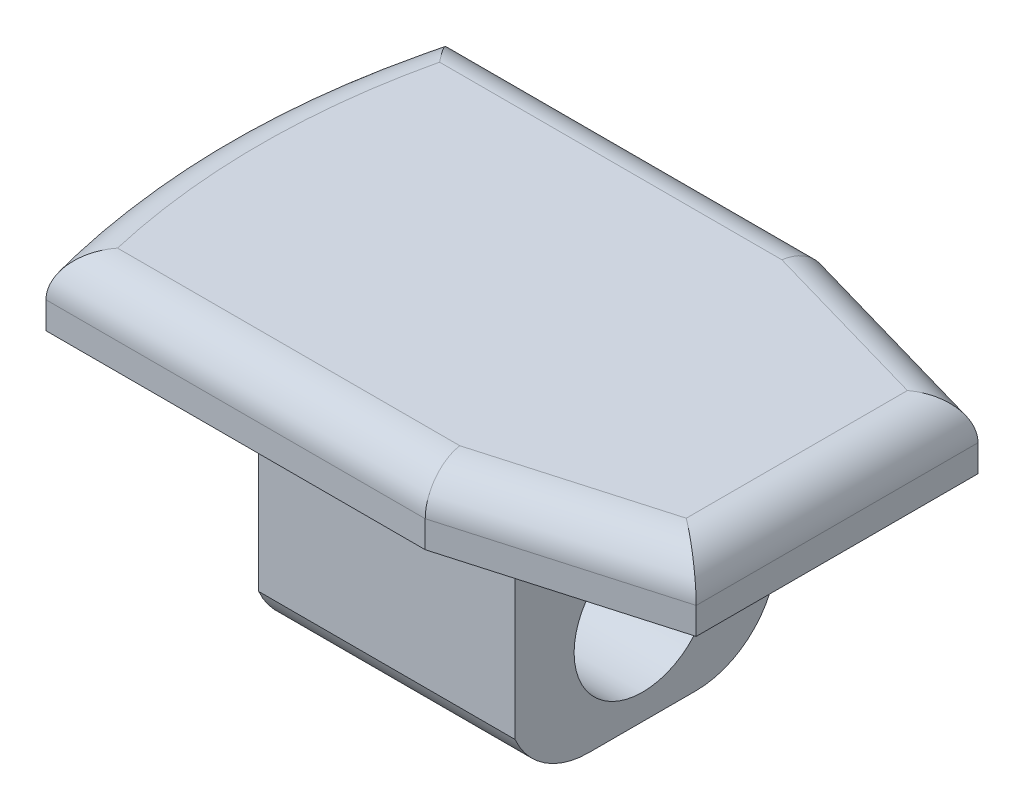
ISO-10303-21;
HEADER;
FILE_DESCRIPTION(('STEP AP214'),'2;1');
FILE_NAME('part.step','',(''),(''),'','','');
FILE_SCHEMA(('AUTOMOTIVE_DESIGN { 1 0 10303 214 1 1 1 1 }'));
ENDSEC;
DATA;
#1=APPLICATION_CONTEXT('core data for automotive mechanical design processes');
#2=APPLICATION_PROTOCOL_DEFINITION('international standard','automotive_design',2000,#1);
#3=PRODUCT_CONTEXT('',#1,'mechanical');
#4=PRODUCT('Part','Part','',(#3));
#5=PRODUCT_RELATED_PRODUCT_CATEGORY('part','',(#4));
#6=PRODUCT_DEFINITION_FORMATION('','',#4);
#7=PRODUCT_DEFINITION_CONTEXT('part definition',#1,'design');
#8=PRODUCT_DEFINITION('design','',#6,#7);
#9=PRODUCT_DEFINITION_SHAPE('','',#8);
#10=(LENGTH_UNIT() NAMED_UNIT(*) SI_UNIT(.MILLI.,.METRE.));
#11=(NAMED_UNIT(*) PLANE_ANGLE_UNIT() SI_UNIT($,.RADIAN.));
#12=(NAMED_UNIT(*) SI_UNIT($,.STERADIAN.) SOLID_ANGLE_UNIT());
#13=UNCERTAINTY_MEASURE_WITH_UNIT(LENGTH_MEASURE(1.E-05),#10,'distance_accuracy_value','');
#14=(GEOMETRIC_REPRESENTATION_CONTEXT(3) GLOBAL_UNCERTAINTY_ASSIGNED_CONTEXT((#13)) GLOBAL_UNIT_ASSIGNED_CONTEXT((#10,
#11,#12)) REPRESENTATION_CONTEXT('',''));
#15=CARTESIAN_POINT('',(0.,0.,0.));
#16=DIRECTION('',(0.,0.,1.));
#17=DIRECTION('',(1.,0.,0.));
#18=AXIS2_PLACEMENT_3D('',#15,#16,#17);
#19=CARTESIAN_POINT('',(0.,2.5,-50.6225865014302));
#20=DIRECTION('',(0.,0.,-1.));
#21=DIRECTION('',(-1.,0.,0.));
#22=AXIS2_PLACEMENT_3D('',#19,#20,#21);
#23=PLANE('',#22);
#24=DIRECTION('',(0.,-1.,0.));
#25=VECTOR('',#24,1.);
#26=CARTESIAN_POINT('',(-34.3395305183971,2.5,-50.6225865014302));
#27=LINE('',#26,#25);
#28=CARTESIAN_POINT('',(-34.3395305183971,1.,-50.6225865014302));
#29=VERTEX_POINT('',#28);
#30=CARTESIAN_POINT('',(-34.3395305183971,0.,-50.6225865014302));
#31=VERTEX_POINT('',#30);
#32=EDGE_CURVE('E284',#29,#31,#27,.T.);
#33=ORIENTED_EDGE('',*,*,#32,.F.);
#34=DIRECTION('',(1.,0.,0.));
#35=VECTOR('',#34,1.);
#36=CARTESIAN_POINT('',(0.,1.,-50.6225865014302));
#37=LINE('',#36,#35);
#38=CARTESIAN_POINT('',(-20.2093710966066,1.,-50.6225865014302));
#39=VERTEX_POINT('',#38);
#40=EDGE_CURVE('E310',#29,#39,#37,.T.);
#41=ORIENTED_EDGE('',*,*,#40,.T.);
#42=DIRECTION('',(0.,-1.,0.));
#43=VECTOR('',#42,1.);
#44=CARTESIAN_POINT('',(-20.2093710966066,2.5,-50.6225865014302));
#45=LINE('',#44,#43);
#46=CARTESIAN_POINT('',(-20.2093710966066,0.,-50.6225865014302));
#47=VERTEX_POINT('',#46);
#48=EDGE_CURVE('E274',#39,#47,#45,.T.);
#49=ORIENTED_EDGE('',*,*,#48,.T.);
#50=DIRECTION('',(1.,0.,0.));
#51=VECTOR('',#50,1.);
#52=CARTESIAN_POINT('',(0.,0.,-50.6225865014302));
#53=LINE('',#52,#51);
#54=EDGE_CURVE('E255',#31,#47,#53,.T.);
#55=ORIENTED_EDGE('',*,*,#54,.F.);
#56=EDGE_LOOP('',(#33,#41,#49,#55));
#57=FACE_BOUND('',#56,.T.);
#58=ADVANCED_FACE('F34',(#57),#23,.T.);
#59=CARTESIAN_POINT('',(-7.36268859796463,2.5,-43.1225865014302));
#60=DIRECTION('',(0.,-1.,0.));
#61=DIRECTION('',(0.,0.,-1.));
#62=AXIS2_PLACEMENT_3D('',#59,#60,#61);
#63=CYLINDRICAL_SURFACE('',#62,28.);
#64=DIRECTION('',(0.,-1.,0.));
#65=VECTOR('',#64,1.);
#66=CARTESIAN_POINT('',(-34.3395305183971,2.5,-35.6225865014302));
#67=LINE('',#66,#65);
#68=CARTESIAN_POINT('',(-34.3395305183971,1.,-35.6225865014302));
#69=VERTEX_POINT('',#68);
#70=CARTESIAN_POINT('',(-34.3395305183971,0.,-35.6225865014302));
#71=VERTEX_POINT('',#70);
#72=EDGE_CURVE('E282',#69,#71,#67,.T.);
#73=ORIENTED_EDGE('',*,*,#72,.F.);
#74=CARTESIAN_POINT('',(-7.36268859796463,1.,-43.1225865014302));
#75=DIRECTION('',(0.,1.,0.));
#76=DIRECTION('',(0.,0.,1.));
#77=AXIS2_PLACEMENT_3D('',#74,#75,#76);
#78=CIRCLE('',#77,28.);
#79=EDGE_CURVE('E308',#69,#29,#78,.F.);
#80=ORIENTED_EDGE('',*,*,#79,.T.);
#81=ORIENTED_EDGE('',*,*,#32,.T.);
#82=CARTESIAN_POINT('',(-7.36268859796463,0.,-43.1225865014302));
#83=DIRECTION('',(0.,1.,0.));
#84=DIRECTION('',(0.,0.,1.));
#85=AXIS2_PLACEMENT_3D('',#82,#83,#84);
#86=CIRCLE('',#85,28.);
#87=EDGE_CURVE('E258',#31,#71,#86,.T.);
#88=ORIENTED_EDGE('',*,*,#87,.T.);
#89=EDGE_LOOP('',(#73,#80,#81,#88));
#90=FACE_BOUND('',#89,.T.);
#91=ADVANCED_FACE('F366',(#90),#63,.T.);
#92=CARTESIAN_POINT('',(0.,2.5,-35.6225865014302));
#93=DIRECTION('',(0.,0.,1.));
#94=DIRECTION('',(1.,0.,0.));
#95=AXIS2_PLACEMENT_3D('',#92,#93,#94);
#96=PLANE('',#95);
#97=DIRECTION('',(0.,-1.,0.));
#98=VECTOR('',#97,1.);
#99=CARTESIAN_POINT('',(-20.2093710966067,2.5,-35.6225865014302));
#100=LINE('',#99,#98);
#101=CARTESIAN_POINT('',(-20.2093710966067,1.,-35.6225865014302));
#102=VERTEX_POINT('',#101);
#103=CARTESIAN_POINT('',(-20.2093710966067,0.,-35.6225865014302));
#104=VERTEX_POINT('',#103);
#105=EDGE_CURVE('E280',#102,#104,#100,.T.);
#106=ORIENTED_EDGE('',*,*,#105,.F.);
#107=DIRECTION('',(-1.,0.,0.));
#108=VECTOR('',#107,1.);
#109=CARTESIAN_POINT('',(0.,1.,-35.6225865014302));
#110=LINE('',#109,#108);
#111=EDGE_CURVE('E306',#102,#69,#110,.T.);
#112=ORIENTED_EDGE('',*,*,#111,.T.);
#113=ORIENTED_EDGE('',*,*,#72,.T.);
#114=DIRECTION('',(-1.,0.,0.));
#115=VECTOR('',#114,1.);
#116=CARTESIAN_POINT('',(0.,0.,-35.6225865014302));
#117=LINE('',#116,#115);
#118=EDGE_CURVE('E262',#104,#71,#117,.T.);
#119=ORIENTED_EDGE('',*,*,#118,.F.);
#120=EDGE_LOOP('',(#106,#112,#113,#119));
#121=FACE_BOUND('',#120,.T.);
#122=ADVANCED_FACE('F372',(#121),#96,.T.);
#123=CARTESIAN_POINT('',(-10.9739736212662,2.5,-38.2707941131326));
#124=DIRECTION('',(0.275637355817,0.,0.961261695938319));
#125=DIRECTION('',(0.961261695938319,0.,-0.275637355817));
#126=AXIS2_PLACEMENT_3D('',#123,#124,#125);
#127=PLANE('',#126);
#128=DIRECTION('',(0.,-1.,0.));
#129=VECTOR('',#128,1.);
#130=CARTESIAN_POINT('',(-12.3626885979646,2.5,-37.8725865014302));
#131=LINE('',#130,#129);
#132=CARTESIAN_POINT('',(-12.3626885979646,1.,-37.8725865014302));
#133=VERTEX_POINT('',#132);
#134=CARTESIAN_POINT('',(-12.3626885979646,0.,-37.8725865014302));
#135=VERTEX_POINT('',#134);
#136=EDGE_CURVE('E278',#133,#135,#131,.T.);
#137=ORIENTED_EDGE('',*,*,#136,.F.);
#138=DIRECTION('',(-0.961261695938319,0.,0.275637355817));
#139=VECTOR('',#138,1.);
#140=CARTESIAN_POINT('',(-10.9739736212662,1.,-38.2707941131326));
#141=LINE('',#140,#139);
#142=EDGE_CURVE('E304',#133,#102,#141,.T.);
#143=ORIENTED_EDGE('',*,*,#142,.T.);
#144=ORIENTED_EDGE('',*,*,#105,.T.);
#145=DIRECTION('',(-0.961261695938319,0.,0.275637355817));
#146=VECTOR('',#145,1.);
#147=CARTESIAN_POINT('',(-10.9739736212662,0.,-38.2707941131326));
#148=LINE('',#147,#146);
#149=EDGE_CURVE('E265',#135,#104,#148,.T.);
#150=ORIENTED_EDGE('',*,*,#149,.F.);
#151=EDGE_LOOP('',(#137,#143,#144,#150));
#152=FACE_BOUND('',#151,.T.);
#153=ADVANCED_FACE('F400',(#152),#127,.T.);
#154=CARTESIAN_POINT('',(-12.3626885979646,2.5,0.));
#155=DIRECTION('',(1.,0.,0.));
#156=DIRECTION('',(0.,0.,-1.));
#157=AXIS2_PLACEMENT_3D('',#154,#155,#156);
#158=PLANE('',#157);
#159=DIRECTION('',(0.,-1.,0.));
#160=VECTOR('',#159,1.);
#161=CARTESIAN_POINT('',(-12.3626885979646,2.5,-48.3725865014302));
#162=LINE('',#161,#160);
#163=CARTESIAN_POINT('',(-12.3626885979646,1.,-48.3725865014302));
#164=VERTEX_POINT('',#163);
#165=CARTESIAN_POINT('',(-12.3626885979646,0.,-48.3725865014302));
#166=VERTEX_POINT('',#165);
#167=EDGE_CURVE('E276',#164,#166,#162,.T.);
#168=ORIENTED_EDGE('',*,*,#167,.F.);
#169=DIRECTION('',(0.,0.,1.));
#170=VECTOR('',#169,1.);
#171=CARTESIAN_POINT('',(-12.3626885979646,1.,0.));
#172=LINE('',#171,#170);
#173=EDGE_CURVE('E302',#164,#133,#172,.T.);
#174=ORIENTED_EDGE('',*,*,#173,.T.);
#175=ORIENTED_EDGE('',*,*,#136,.T.);
#176=DIRECTION('',(0.,0.,1.));
#177=VECTOR('',#176,1.);
#178=CARTESIAN_POINT('',(-12.3626885979646,0.,0.));
#179=LINE('',#178,#177);
#180=EDGE_CURVE('E268',#166,#135,#179,.T.);
#181=ORIENTED_EDGE('',*,*,#180,.F.);
#182=EDGE_LOOP('',(#168,#174,#175,#181));
#183=FACE_BOUND('',#182,.T.);
#184=ADVANCED_FACE('F424',(#183),#158,.T.);
#185=CARTESIAN_POINT('',(11.8775156894045,2.5,-41.4218197721762));
#186=DIRECTION('',(0.275637355817001,0.,-0.961261695938319));
#187=DIRECTION('',(-0.961261695938319,0.,-0.275637355817001));
#188=AXIS2_PLACEMENT_3D('',#185,#186,#187);
#189=PLANE('',#188);
#190=ORIENTED_EDGE('',*,*,#48,.F.);
#191=DIRECTION('',(0.961261695938319,0.,0.275637355817001));
#192=VECTOR('',#191,1.);
#193=CARTESIAN_POINT('',(11.8775156894045,1.,-41.4218197721762));
#194=LINE('',#193,#192);
#195=EDGE_CURVE('E286',#39,#164,#194,.T.);
#196=ORIENTED_EDGE('',*,*,#195,.T.);
#197=ORIENTED_EDGE('',*,*,#167,.T.);
#198=DIRECTION('',(0.961261695938319,0.,0.275637355817001));
#199=VECTOR('',#198,1.);
#200=CARTESIAN_POINT('',(11.8775156894045,0.,-41.4218197721762));
#201=LINE('',#200,#199);
#202=EDGE_CURVE('E271',#47,#166,#201,.T.);
#203=ORIENTED_EDGE('',*,*,#202,.F.);
#204=EDGE_LOOP('',(#190,#196,#197,#203));
#205=FACE_BOUND('',#204,.T.);
#206=ADVANCED_FACE('F418',(#205),#189,.T.);
#207=CARTESIAN_POINT('',(0.,2.5,0.));
#208=DIRECTION('',(0.,1.,0.));
#209=DIRECTION('',(0.,0.,1.));
#210=AXIS2_PLACEMENT_3D('',#207,#208,#209);
#211=PLANE('',#210);
#212=DIRECTION('',(0.,0.,1.));
#213=VECTOR('',#212,1.);
#214=CARTESIAN_POINT('',(-13.8626885979646,2.5,0.));
#215=LINE('',#214,#213);
#216=CARTESIAN_POINT('',(-13.8626885979646,2.5,-39.0029175765844));
#217=VERTEX_POINT('',#216);
#218=CARTESIAN_POINT('',(-13.8626885979646,2.5,-47.242255426276));
#219=VERTEX_POINT('',#218);
#220=EDGE_CURVE('E297',#217,#219,#215,.F.);
#221=ORIENTED_EDGE('',*,*,#220,.T.);
#222=DIRECTION('',(0.961261695938319,0.,0.275637355817001));
#223=VECTOR('',#222,1.);
#224=CARTESIAN_POINT('',(11.464059655679,2.5,-39.9799272282687));
#225=LINE('',#224,#223);
#226=CARTESIAN_POINT('',(-20.4201823486602,2.5,-49.1225865014302));
#227=VERTEX_POINT('',#226);
#228=EDGE_CURVE('E299',#219,#227,#225,.F.);
#229=ORIENTED_EDGE('',*,*,#228,.T.);
#230=DIRECTION('',(1.,0.,0.));
#231=VECTOR('',#230,1.);
#232=CARTESIAN_POINT('',(0.,2.5,-49.1225865014302));
#233=LINE('',#232,#231);
#234=CARTESIAN_POINT('',(-33.1745075962452,2.5,-49.1225865014302));
#235=VERTEX_POINT('',#234);
#236=EDGE_CURVE('E289',#227,#235,#233,.F.);
#237=ORIENTED_EDGE('',*,*,#236,.T.);
#238=CARTESIAN_POINT('',(-7.36268859796463,2.5,-43.1225865014302));
#239=DIRECTION('',(0.,1.,0.));
#240=DIRECTION('',(0.,0.,1.));
#241=AXIS2_PLACEMENT_3D('',#238,#239,#240);
#242=CIRCLE('',#241,26.5);
#243=CARTESIAN_POINT('',(-33.1745075962452,2.5,-37.1225865014302));
#244=VERTEX_POINT('',#243);
#245=EDGE_CURVE('E291',#235,#244,#242,.T.);
#246=ORIENTED_EDGE('',*,*,#245,.T.);
#247=DIRECTION('',(-1.,0.,0.));
#248=VECTOR('',#247,1.);
#249=CARTESIAN_POINT('',(0.,2.5,-37.1225865014302));
#250=LINE('',#249,#248);
#251=CARTESIAN_POINT('',(-20.4201823486603,2.5,-37.1225865014302));
#252=VERTEX_POINT('',#251);
#253=EDGE_CURVE('E293',#244,#252,#250,.F.);
#254=ORIENTED_EDGE('',*,*,#253,.T.);
#255=DIRECTION('',(-0.961261695938319,0.,0.275637355817));
#256=VECTOR('',#255,1.);
#257=CARTESIAN_POINT('',(-11.3874296549917,2.5,-39.7126866570401));
#258=LINE('',#257,#256);
#259=EDGE_CURVE('E295',#252,#217,#258,.F.);
#260=ORIENTED_EDGE('',*,*,#259,.T.);
#261=EDGE_LOOP('',(#221,#229,#237,#246,#254,#260));
#262=FACE_BOUND('',#261,.T.);
#263=ADVANCED_FACE('F431',(#262),#211,.T.);
#264=CARTESIAN_POINT('',(0.,0.,0.));
#265=DIRECTION('',(0.,1.,0.));
#266=DIRECTION('',(0.,0.,1.));
#267=AXIS2_PLACEMENT_3D('',#264,#265,#266);
#268=PLANE('',#267);
#269=ORIENTED_EDGE('',*,*,#54,.T.);
#270=ORIENTED_EDGE('',*,*,#202,.T.);
#271=ORIENTED_EDGE('',*,*,#180,.T.);
#272=ORIENTED_EDGE('',*,*,#149,.T.);
#273=ORIENTED_EDGE('',*,*,#118,.T.);
#274=ORIENTED_EDGE('',*,*,#87,.F.);
#275=EDGE_LOOP('',(#269,#270,#271,#272,#273,#274));
#276=FACE_BOUND('',#275,.T.);
#277=DIRECTION('',(0.,0.,1.));
#278=VECTOR('',#277,1.);
#279=CARTESIAN_POINT('',(-19.6126885979646,0.,-47.8725865014302));
#280=LINE('',#279,#278);
#281=CARTESIAN_POINT('',(-19.6126885979646,0.,-47.8725865014302));
#282=VERTEX_POINT('',#281);
#283=CARTESIAN_POINT('',(-19.6126885979646,0.,-38.3725865014302));
#284=VERTEX_POINT('',#283);
#285=EDGE_CURVE('E191',#282,#284,#280,.T.);
#286=ORIENTED_EDGE('',*,*,#285,.F.);
#287=DIRECTION('',(1.,0.,0.));
#288=VECTOR('',#287,1.);
#289=CARTESIAN_POINT('',(-32.6707900676522,0.,-47.8725865014302));
#290=LINE('',#289,#288);
#291=CARTESIAN_POINT('',(-32.6707900676522,0.,-47.8725865014302));
#292=VERTEX_POINT('',#291);
#293=EDGE_CURVE('E203',#292,#282,#290,.T.);
#294=ORIENTED_EDGE('',*,*,#293,.F.);
#295=CARTESIAN_POINT('',(-7.36268859796419,0.,-43.1225865014302));
#296=DIRECTION('',(0.,-1.,0.));
#297=DIRECTION('',(0.,0.,-1.));
#298=AXIS2_PLACEMENT_3D('',#295,#296,#297);
#299=CIRCLE('',#298,25.7500000000004);
#300=CARTESIAN_POINT('',(-32.6707900676522,0.,-38.3725865014302));
#301=VERTEX_POINT('',#300);
#302=EDGE_CURVE('E194',#301,#292,#299,.T.);
#303=ORIENTED_EDGE('',*,*,#302,.F.);
#304=DIRECTION('',(-1.,0.,0.));
#305=VECTOR('',#304,1.);
#306=CARTESIAN_POINT('',(-19.6126885979646,0.,-38.3725865014302));
#307=LINE('',#306,#305);
#308=EDGE_CURVE('E179',#284,#301,#307,.T.);
#309=ORIENTED_EDGE('',*,*,#308,.F.);
#310=EDGE_LOOP('',(#286,#294,#303,#309));
#311=FACE_BOUND('',#310,.T.);
#312=ADVANCED_FACE('F189',(#276,#311),#268,.F.);
#313=CARTESIAN_POINT('',(0.,1.,-37.1225865014302));
#314=DIRECTION('',(-1.,0.,0.));
#315=DIRECTION('',(0.,0.,1.));
#316=AXIS2_PLACEMENT_3D('',#313,#314,#315);
#317=CYLINDRICAL_SURFACE('',#316,1.5);
#318=CARTESIAN_POINT('',(-20.4201823486602,1.,-37.1225865014302));
#319=DIRECTION('',(-0.99026806874157,0.,0.139173100960066));
#320=DIRECTION('',(-0.139173100960065,0.,-0.990268068741571));
#321=AXIS2_PLACEMENT_3D('',#318,#319,#320);
#322=ELLIPSE('',#321,1.51474135877793,1.5);
#323=EDGE_CURVE('E327',#252,#102,#322,.F.);
#324=ORIENTED_EDGE('',*,*,#323,.F.);
#325=ORIENTED_EDGE('',*,*,#253,.F.);
#326=CARTESIAN_POINT('',(-34.3395305183971,1.,-35.6225865014302));
#327=CARTESIAN_POINT('',(-34.3395328536621,1.03608039633348,-35.6225831912668));
#328=CARTESIAN_POINT('',(-34.3385404683693,1.07214073475895,-35.6238893730918));
#329=CARTESIAN_POINT('',(-34.3345984808231,1.14395069350024,-35.629076334847));
#330=CARTESIAN_POINT('',(-34.3316498387002,1.17970045753022,-35.6329558517845));
#331=CARTESIAN_POINT('',(-34.319969056972,1.28565336330926,-35.6483204930772));
#332=CARTESIAN_POINT('',(-34.3084010639559,1.35505300951268,-35.6635330711589));
#333=CARTESIAN_POINT('',(-34.2783868681752,1.48946757320146,-35.7029622916945));
#334=CARTESIAN_POINT('',(-34.2599513826133,1.5544891372799,-35.7271649044028));
#335=CARTESIAN_POINT('',(-34.217104665054,1.6790332073116,-35.7833376181721));
#336=CARTESIAN_POINT('',(-34.1926856984093,1.73854845715303,-35.815317772599));
#337=CARTESIAN_POINT('',(-34.1369878809526,1.85509812562639,-35.8881407477034));
#338=CARTESIAN_POINT('',(-34.1053485798,1.91166753970272,-35.929447139332));
#339=CARTESIAN_POINT('',(-34.0375150597707,2.01697248513691,-36.0178251568492));
#340=CARTESIAN_POINT('',(-34.0013197309525,2.06570610092307,-36.0648981875339));
#341=CARTESIAN_POINT('',(-33.917993242335,2.16389046813266,-36.173021751085));
#342=CARTESIAN_POINT('',(-33.8701012483687,2.21165520298172,-36.2350143903203));
#343=CARTESIAN_POINT('',(-33.7705728945552,2.29601487337483,-36.3634677470013));
#344=CARTESIAN_POINT('',(-33.718932450196,2.33259739103286,-36.429933332484));
#345=CARTESIAN_POINT('',(-33.601806604551,2.40144117104505,-36.5802156979388));
#346=CARTESIAN_POINT('',(-33.5357063948009,2.4311436552944,-36.6647245167518));
#347=CARTESIAN_POINT('',(-33.4013440779191,2.47497769745559,-36.8358286525521));
#348=CARTESIAN_POINT('',(-33.3330847051392,2.48912819737013,-36.922421299755));
#349=CARTESIAN_POINT('',(-33.236138250163,2.49841641038692,-37.0449135449037));
#350=CARTESIAN_POINT('',(-33.207778480836,2.4998409322229,-37.0806873575064));
#351=CARTESIAN_POINT('',(-33.1777616500822,2.49999580166227,-37.118489085609));
#352=CARTESIAN_POINT('',(-33.1761346692557,2.49999999852218,-37.120537832223));
#353=CARTESIAN_POINT('',(-33.1745075962452,2.5,-37.1225865014302));
#354=B_SPLINE_CURVE_WITH_KNOTS('',3,(#326,#327,#328,#329,#330,#331,#332,#333,#334,#335,#336,
#337,#338,#339,#340,#341,#342,#343,#344,#345,#346,#347,#348,#349,#350,#351,#352,#353),
.UNSPECIFIED.,.F.,.F.,(4,2,2,2,2,2,2,2,2,2,2,2,2,4),(0.,0.108165320883747,0.216277593476679,
0.431044770958129,0.645478183814628,0.860190263630719,1.08992666101489,1.31971913559943,
1.59397754445659,1.86853942079571,2.20128774687989,2.53363034153708,2.67059182436621,
2.67844038135514),.UNSPECIFIED.);
#355=EDGE_CURVE('E259',#69,#244,#354,.T.);
#356=ORIENTED_EDGE('',*,*,#355,.F.);
#357=ORIENTED_EDGE('',*,*,#111,.F.);
#358=EDGE_LOOP('',(#324,#325,#356,#357));
#359=FACE_BOUND('',#358,.T.);
#360=ADVANCED_FACE('F337',(#359),#317,.T.);
#361=CARTESIAN_POINT('',(-7.36268859796463,1.,-43.1225865014302));
#362=DIRECTION('',(0.,1.,0.));
#363=DIRECTION('',(0.,0.,1.));
#364=AXIS2_PLACEMENT_3D('',#361,#362,#363);
#365=TOROIDAL_SURFACE('',#364,26.5,1.5);
#366=ORIENTED_EDGE('',*,*,#355,.T.);
#367=ORIENTED_EDGE('',*,*,#245,.F.);
#368=CARTESIAN_POINT('',(-34.3395305183971,1.,-50.6225865014302));
#369=CARTESIAN_POINT('',(-34.3395328536621,1.03608039633348,-50.6225898115936));
#370=CARTESIAN_POINT('',(-34.3385404683693,1.07214073475895,-50.6212836297686));
#371=CARTESIAN_POINT('',(-34.3345984808231,1.14395069350024,-50.6160966680133));
#372=CARTESIAN_POINT('',(-34.3316498387002,1.17970045753022,-50.6122171510758));
#373=CARTESIAN_POINT('',(-34.319969056972,1.28565336330926,-50.5968525097832));
#374=CARTESIAN_POINT('',(-34.3084010639559,1.35505300951268,-50.5816399317015));
#375=CARTESIAN_POINT('',(-34.2783868681752,1.48946757320146,-50.5422107111658));
#376=CARTESIAN_POINT('',(-34.2599513826133,1.5544891372799,-50.5180080984575));
#377=CARTESIAN_POINT('',(-34.217104665054,1.6790332073116,-50.4618353846883));
#378=CARTESIAN_POINT('',(-34.1926856984093,1.73854845715303,-50.4298552302614));
#379=CARTESIAN_POINT('',(-34.1369878809526,1.85509812562639,-50.357032255157));
#380=CARTESIAN_POINT('',(-34.1053485798,1.91166753970272,-50.3157258635284));
#381=CARTESIAN_POINT('',(-34.0375150597707,2.01697248513691,-50.2273478460112));
#382=CARTESIAN_POINT('',(-34.0013197309525,2.06570610092307,-50.1802748153265));
#383=CARTESIAN_POINT('',(-33.917993242335,2.16389046813266,-50.0721512517754));
#384=CARTESIAN_POINT('',(-33.8701012483687,2.21165520298172,-50.0101586125401));
#385=CARTESIAN_POINT('',(-33.7705728945552,2.29601487337483,-49.8817052558591));
#386=CARTESIAN_POINT('',(-33.718932450196,2.33259739103286,-49.8152396703764));
#387=CARTESIAN_POINT('',(-33.601806604551,2.40144117104505,-49.6649573049216));
#388=CARTESIAN_POINT('',(-33.5357063948009,2.4311436552944,-49.5804484861086));
#389=CARTESIAN_POINT('',(-33.4013440779191,2.47497769745559,-49.4093443503083));
#390=CARTESIAN_POINT('',(-33.3330847051392,2.48912819737013,-49.3227517031054));
#391=CARTESIAN_POINT('',(-33.236138250163,2.49841641038692,-49.2002594579567));
#392=CARTESIAN_POINT('',(-33.207778480836,2.4998409322229,-49.164485645354));
#393=CARTESIAN_POINT('',(-33.1777616500822,2.49999580166227,-49.1266839172514));
#394=CARTESIAN_POINT('',(-33.1761346692557,2.49999999852218,-49.1246351706373));
#395=CARTESIAN_POINT('',(-33.1745075962452,2.5,-49.1225865014302));
#396=B_SPLINE_CURVE_WITH_KNOTS('',3,(#368,#369,#370,#371,#372,#373,#374,#375,#376,#377,#378,
#379,#380,#381,#382,#383,#384,#385,#386,#387,#388,#389,#390,#391,#392,#393,#394,#395),
.UNSPECIFIED.,.F.,.F.,(4,2,2,2,2,2,2,2,2,2,2,2,2,4),(0.,0.108165320883747,0.216277593476679,
0.431044770958129,0.645478183814628,0.860190263630719,1.08992666101489,1.31971913559943,
1.59397754445659,1.86853942079571,2.20128774687989,2.53363034153708,2.67059182436621,
2.67844038135514),.UNSPECIFIED.);
#397=EDGE_CURVE('E319',#29,#235,#396,.T.);
#398=ORIENTED_EDGE('',*,*,#397,.F.);
#399=ORIENTED_EDGE('',*,*,#79,.F.);
#400=EDGE_LOOP('',(#366,#367,#398,#399));
#401=FACE_BOUND('',#400,.T.);
#402=ADVANCED_FACE('F332',(#401),#365,.T.);
#403=CARTESIAN_POINT('',(-11.3874296549917,1.,-39.7126866570401));
#404=DIRECTION('',(-0.961261695938319,0.,0.275637355817));
#405=DIRECTION('',(0.275637355817,0.,0.961261695938319));
#406=AXIS2_PLACEMENT_3D('',#403,#404,#405);
#407=CYLINDRICAL_SURFACE('',#406,1.5);
#408=ORIENTED_EDGE('',*,*,#323,.T.);
#409=ORIENTED_EDGE('',*,*,#142,.F.);
#410=CARTESIAN_POINT('',(-13.8626885979646,1.,-39.0029175765844));
#411=DIRECTION('',(-0.601815023152048,0.,0.798635510047293));
#412=DIRECTION('',(-0.798635510047293,0.,-0.601815023152048));
#413=AXIS2_PLACEMENT_3D('',#410,#411,#412);
#414=ELLIPSE('',#413,1.87820348723434,1.5);
#415=EDGE_CURVE('E316',#217,#133,#414,.F.);
#416=ORIENTED_EDGE('',*,*,#415,.F.);
#417=ORIENTED_EDGE('',*,*,#259,.F.);
#418=EDGE_LOOP('',(#408,#409,#416,#417));
#419=FACE_BOUND('',#418,.T.);
#420=ADVANCED_FACE('F336',(#419),#407,.T.);
#421=CARTESIAN_POINT('',(0.,1.,-49.1225865014302));
#422=DIRECTION('',(1.,0.,0.));
#423=DIRECTION('',(0.,0.,-1.));
#424=AXIS2_PLACEMENT_3D('',#421,#422,#423);
#425=CYLINDRICAL_SURFACE('',#424,1.5);
#426=ORIENTED_EDGE('',*,*,#397,.T.);
#427=ORIENTED_EDGE('',*,*,#236,.F.);
#428=CARTESIAN_POINT('',(-20.4201823486602,1.,-49.1225865014302));
#429=DIRECTION('',(0.99026806874157,0.,0.139173100960066));
#430=DIRECTION('',(0.139173100960066,0.,-0.99026806874157));
#431=AXIS2_PLACEMENT_3D('',#428,#429,#430);
#432=ELLIPSE('',#431,1.51474135877793,1.5);
#433=EDGE_CURVE('E314',#39,#227,#432,.T.);
#434=ORIENTED_EDGE('',*,*,#433,.F.);
#435=ORIENTED_EDGE('',*,*,#40,.F.);
#436=EDGE_LOOP('',(#426,#427,#434,#435));
#437=FACE_BOUND('',#436,.T.);
#438=ADVANCED_FACE('F329',(#437),#425,.T.);
#439=CARTESIAN_POINT('',(-13.8626885979646,1.,0.));
#440=DIRECTION('',(0.,0.,1.));
#441=DIRECTION('',(1.,0.,0.));
#442=AXIS2_PLACEMENT_3D('',#439,#440,#441);
#443=CYLINDRICAL_SURFACE('',#442,1.5);
#444=ORIENTED_EDGE('',*,*,#415,.T.);
#445=ORIENTED_EDGE('',*,*,#173,.F.);
#446=CARTESIAN_POINT('',(-13.8626885979646,1.,-47.242255426276));
#447=DIRECTION('',(0.601815023152048,0.,0.798635510047293));
#448=DIRECTION('',(-0.798635510047293,0.,0.601815023152048));
#449=AXIS2_PLACEMENT_3D('',#446,#447,#448);
#450=ELLIPSE('',#449,1.87820348723434,1.5);
#451=EDGE_CURVE('E254',#219,#164,#450,.F.);
#452=ORIENTED_EDGE('',*,*,#451,.F.);
#453=ORIENTED_EDGE('',*,*,#220,.F.);
#454=EDGE_LOOP('',(#444,#445,#452,#453));
#455=FACE_BOUND('',#454,.T.);
#456=ADVANCED_FACE('F380',(#455),#443,.T.);
#457=CARTESIAN_POINT('',(11.464059655679,1.,-39.9799272282687));
#458=DIRECTION('',(0.961261695938319,0.,0.275637355817001));
#459=DIRECTION('',(0.275637355817001,0.,-0.961261695938319));
#460=AXIS2_PLACEMENT_3D('',#457,#458,#459);
#461=CYLINDRICAL_SURFACE('',#460,1.5);
#462=ORIENTED_EDGE('',*,*,#433,.T.);
#463=ORIENTED_EDGE('',*,*,#228,.F.);
#464=ORIENTED_EDGE('',*,*,#451,.T.);
#465=ORIENTED_EDGE('',*,*,#195,.F.);
#466=EDGE_LOOP('',(#462,#463,#464,#465));
#467=FACE_BOUND('',#466,.T.);
#468=ADVANCED_FACE('F378',(#467),#461,.T.);
#469=CARTESIAN_POINT('',(-19.6126885979646,-10.,-47.8725865014302));
#470=DIRECTION('',(-1.,0.,0.));
#471=DIRECTION('',(0.,0.,1.));
#472=AXIS2_PLACEMENT_3D('',#469,#470,#471);
#473=PLANE('',#472);
#474=CARTESIAN_POINT('',(-19.6126885979646,-6.,-45.1225865014302));
#475=DIRECTION('',(-1.,0.,0.));
#476=DIRECTION('',(0.,0.,1.));
#477=AXIS2_PLACEMENT_3D('',#474,#475,#476);
#478=CIRCLE('',#477,3.);
#479=CARTESIAN_POINT('',(-19.6126885979646,-9.,-45.1225865014302));
#480=VERTEX_POINT('',#479);
#481=CARTESIAN_POINT('',(-19.6126885979646,-7.19895788082821,-47.8725865014302));
#482=VERTEX_POINT('',#481);
#483=EDGE_CURVE('E214',#480,#482,#478,.F.);
#484=ORIENTED_EDGE('',*,*,#483,.T.);
#485=DIRECTION('',(0.,1.,0.));
#486=VECTOR('',#485,1.);
#487=CARTESIAN_POINT('',(-19.6126885979646,-10.,-47.8725865014302));
#488=LINE('',#487,#486);
#489=EDGE_CURVE('E199',#482,#282,#488,.T.);
#490=ORIENTED_EDGE('',*,*,#489,.T.);
#491=ORIENTED_EDGE('',*,*,#285,.T.);
#492=DIRECTION('',(0.,1.,0.));
#493=VECTOR('',#492,1.);
#494=CARTESIAN_POINT('',(-19.6126885979646,-10.,-38.3725865014302));
#495=LINE('',#494,#493);
#496=CARTESIAN_POINT('',(-19.6126885979646,-7.19895788082817,-38.3725865014302));
#497=VERTEX_POINT('',#496);
#498=EDGE_CURVE('E175',#497,#284,#495,.T.);
#499=ORIENTED_EDGE('',*,*,#498,.F.);
#500=CARTESIAN_POINT('',(-19.6126885979646,-6.,-41.1225865014302));
#501=DIRECTION('',(-1.,0.,0.));
#502=DIRECTION('',(0.,0.,1.));
#503=AXIS2_PLACEMENT_3D('',#500,#501,#502);
#504=CIRCLE('',#503,3.);
#505=CARTESIAN_POINT('',(-19.6126885979646,-9.,-41.1225865014302));
#506=VERTEX_POINT('',#505);
#507=EDGE_CURVE('E675',#497,#506,#504,.F.);
#508=ORIENTED_EDGE('',*,*,#507,.T.);
#509=DIRECTION('',(0.,0.,-1.));
#510=VECTOR('',#509,1.);
#511=CARTESIAN_POINT('',(-19.6126885979646,-9.,0.));
#512=LINE('',#511,#510);
#513=EDGE_CURVE('E212',#506,#480,#512,.T.);
#514=ORIENTED_EDGE('',*,*,#513,.T.);
#515=EDGE_LOOP('',(#484,#490,#491,#499,#508,#514));
#516=FACE_BOUND('',#515,.T.);
#517=CARTESIAN_POINT('',(-19.6126885979646,-5.5,-43.1225865014302));
#518=DIRECTION('',(-1.,0.,0.));
#519=DIRECTION('',(0.,0.,1.));
#520=AXIS2_PLACEMENT_3D('',#517,#518,#519);
#521=CIRCLE('',#520,2.55);
#522=CARTESIAN_POINT('',(-19.6126885979646,-5.5,-40.5725865014302));
#523=VERTEX_POINT('',#522);
#524=EDGE_CURVE('E216',#523,#523,#521,.F.);
#525=ORIENTED_EDGE('',*,*,#524,.F.);
#526=EDGE_LOOP('',(#525));
#527=FACE_BOUND('',#526,.T.);
#528=ADVANCED_FACE('F196',(#516,#527),#473,.F.);
#529=CARTESIAN_POINT('',(-19.6126885979646,-10.,-38.3725865014302));
#530=DIRECTION('',(0.,0.,-1.));
#531=DIRECTION('',(-1.,0.,0.));
#532=AXIS2_PLACEMENT_3D('',#529,#530,#531);
#533=PLANE('',#532);
#534=DIRECTION('',(1.,0.,0.));
#535=VECTOR('',#534,1.);
#536=CARTESIAN_POINT('',(0.,-1.5,-38.3725865014302));
#537=LINE('',#536,#535);
#538=CARTESIAN_POINT('',(-32.6707900676522,-1.5,-38.3725865014302));
#539=VERTEX_POINT('',#538);
#540=CARTESIAN_POINT('',(-29.1626885979646,-1.5,-38.3725865014302));
#541=VERTEX_POINT('',#540);
#542=EDGE_CURVE('E210',#539,#541,#537,.T.);
#543=ORIENTED_EDGE('',*,*,#542,.T.);
#544=DIRECTION('',(0.,1.,0.));
#545=VECTOR('',#544,1.);
#546=CARTESIAN_POINT('',(-29.1626885979646,-9.,-38.3725865014302));
#547=LINE('',#546,#545);
#548=CARTESIAN_POINT('',(-29.1626885979646,-7.19895788082817,-38.3725865014302));
#549=VERTEX_POINT('',#548);
#550=EDGE_CURVE('E49',#549,#541,#547,.T.);
#551=ORIENTED_EDGE('',*,*,#550,.F.);
#552=DIRECTION('',(1.,0.,0.));
#553=VECTOR('',#552,1.);
#554=CARTESIAN_POINT('',(0.,-7.19895788082817,-38.3725865014302));
#555=LINE('',#554,#553);
#556=EDGE_CURVE('E180',#549,#497,#555,.T.);
#557=ORIENTED_EDGE('',*,*,#556,.T.);
#558=ORIENTED_EDGE('',*,*,#498,.T.);
#559=ORIENTED_EDGE('',*,*,#308,.T.);
#560=DIRECTION('',(0.,1.,0.));
#561=VECTOR('',#560,1.);
#562=CARTESIAN_POINT('',(-32.6707900676522,-10.,-38.3725865014302));
#563=LINE('',#562,#561);
#564=EDGE_CURVE('E184',#539,#301,#563,.T.);
#565=ORIENTED_EDGE('',*,*,#564,.F.);
#566=EDGE_LOOP('',(#543,#551,#557,#558,#559,#565));
#567=FACE_BOUND('',#566,.T.);
#568=ADVANCED_FACE('F177',(#567),#533,.F.);
#569=CARTESIAN_POINT('',(-7.36268859796419,-10.,-43.1225865014302));
#570=DIRECTION('',(0.,1.,0.));
#571=DIRECTION('',(0.,0.,1.));
#572=AXIS2_PLACEMENT_3D('',#569,#570,#571);
#573=CYLINDRICAL_SURFACE('',#572,25.7500000000004);
#574=CARTESIAN_POINT('',(-7.36268859796419,-1.5,-43.1225865014302));
#575=DIRECTION('',(0.,-1.,0.));
#576=DIRECTION('',(0.,0.,-1.));
#577=AXIS2_PLACEMENT_3D('',#574,#575,#576);
#578=CIRCLE('',#577,25.7500000000004);
#579=CARTESIAN_POINT('',(-32.6707900676522,-1.5,-47.8725865014302));
#580=VERTEX_POINT('',#579);
#581=EDGE_CURVE('E11',#580,#539,#578,.F.);
#582=ORIENTED_EDGE('',*,*,#581,.T.);
#583=ORIENTED_EDGE('',*,*,#564,.T.);
#584=ORIENTED_EDGE('',*,*,#302,.T.);
#585=DIRECTION('',(0.,1.,0.));
#586=VECTOR('',#585,1.);
#587=CARTESIAN_POINT('',(-32.6707900676522,-10.,-47.8725865014302));
#588=LINE('',#587,#586);
#589=EDGE_CURVE('E206',#580,#292,#588,.T.);
#590=ORIENTED_EDGE('',*,*,#589,.F.);
#591=EDGE_LOOP('',(#582,#583,#584,#590));
#592=FACE_BOUND('',#591,.T.);
#593=ADVANCED_FACE('F579',(#592),#573,.T.);
#594=CARTESIAN_POINT('',(-32.6707900676522,-10.,-47.8725865014302));
#595=DIRECTION('',(0.,0.,1.));
#596=DIRECTION('',(1.,0.,0.));
#597=AXIS2_PLACEMENT_3D('',#594,#595,#596);
#598=PLANE('',#597);
#599=DIRECTION('',(-1.,0.,0.));
#600=VECTOR('',#599,1.);
#601=CARTESIAN_POINT('',(0.,-1.5,-47.8725865014302));
#602=LINE('',#601,#600);
#603=CARTESIAN_POINT('',(-29.1626885979646,-1.5,-47.8725865014302));
#604=VERTEX_POINT('',#603);
#605=EDGE_CURVE('E222',#604,#580,#602,.T.);
#606=ORIENTED_EDGE('',*,*,#605,.T.);
#607=ORIENTED_EDGE('',*,*,#589,.T.);
#608=ORIENTED_EDGE('',*,*,#293,.T.);
#609=ORIENTED_EDGE('',*,*,#489,.F.);
#610=DIRECTION('',(-1.,0.,0.));
#611=VECTOR('',#610,1.);
#612=CARTESIAN_POINT('',(0.,-7.19895788082821,-47.8725865014302));
#613=LINE('',#612,#611);
#614=CARTESIAN_POINT('',(-29.1626885979646,-7.19895788082821,-47.8725865014302));
#615=VERTEX_POINT('',#614);
#616=EDGE_CURVE('E42',#482,#615,#613,.T.);
#617=ORIENTED_EDGE('',*,*,#616,.T.);
#618=DIRECTION('',(0.,-1.,0.));
#619=VECTOR('',#618,1.);
#620=CARTESIAN_POINT('',(-29.1626885979646,-9.,-47.8725865014302));
#621=LINE('',#620,#619);
#622=EDGE_CURVE('E219',#604,#615,#621,.T.);
#623=ORIENTED_EDGE('',*,*,#622,.F.);
#624=EDGE_LOOP('',(#606,#607,#608,#609,#617,#623));
#625=FACE_BOUND('',#624,.T.);
#626=ADVANCED_FACE('F544',(#625),#598,.F.);
#627=CARTESIAN_POINT('',(-27.3626885979646,-5.5,-43.1225865014302));
#628=DIRECTION('',(1.,0.,0.));
#629=DIRECTION('',(0.,0.,-1.));
#630=AXIS2_PLACEMENT_3D('',#627,#628,#629);
#631=PLANE('',#630);
#632=CARTESIAN_POINT('',(-27.3626885979646,-5.5,-43.1225865014302));
#633=DIRECTION('',(1.,0.,0.));
#634=DIRECTION('',(0.,0.,-1.));
#635=AXIS2_PLACEMENT_3D('',#632,#633,#634);
#636=CIRCLE('',#635,3.);
#637=CARTESIAN_POINT('',(-27.3626885979646,-5.5,-46.1225865014302));
#638=VERTEX_POINT('',#637);
#639=EDGE_CURVE('E224',#638,#638,#636,.T.);
#640=ORIENTED_EDGE('',*,*,#639,.F.);
#641=EDGE_LOOP('',(#640));
#642=FACE_BOUND('',#641,.T.);
#643=CARTESIAN_POINT('',(-27.3626885979646,-5.5,-43.1225865014302));
#644=DIRECTION('',(1.,0.,0.));
#645=DIRECTION('',(0.,0.,-1.));
#646=AXIS2_PLACEMENT_3D('',#643,#644,#645);
#647=CIRCLE('',#646,2.55);
#648=CARTESIAN_POINT('',(-27.3626885979646,-5.5,-45.6725865014302));
#649=VERTEX_POINT('',#648);
#650=EDGE_CURVE('E234',#649,#649,#647,.F.);
#651=ORIENTED_EDGE('',*,*,#650,.F.);
#652=EDGE_LOOP('',(#651));
#653=FACE_BOUND('',#652,.T.);
#654=ADVANCED_FACE('F540',(#642,#653),#631,.F.);
#655=CARTESIAN_POINT('',(-27.3626885979646,-5.5,-43.1225865014302));
#656=DIRECTION('',(1.,0.,0.));
#657=DIRECTION('',(0.,0.,-1.));
#658=AXIS2_PLACEMENT_3D('',#655,#656,#657);
#659=CYLINDRICAL_SURFACE('',#658,2.55);
#660=ORIENTED_EDGE('',*,*,#524,.T.);
#661=EDGE_LOOP('',(#660));
#662=FACE_BOUND('',#661,.T.);
#663=ORIENTED_EDGE('',*,*,#650,.T.);
#664=EDGE_LOOP('',(#663));
#665=FACE_BOUND('',#664,.T.);
#666=ADVANCED_FACE('F543',(#662,#665),#659,.F.);
#667=CARTESIAN_POINT('',(-30.3626885979646,-5.5,-43.1225865014302));
#668=DIRECTION('',(1.,0.,0.));
#669=DIRECTION('',(0.,0.,-1.));
#670=AXIS2_PLACEMENT_3D('',#667,#668,#669);
#671=CYLINDRICAL_SURFACE('',#670,3.);
#672=ORIENTED_EDGE('',*,*,#639,.T.);
#673=EDGE_LOOP('',(#672));
#674=FACE_BOUND('',#673,.T.);
#675=CARTESIAN_POINT('',(-28.4060158577306,-5.5,-43.1225865014302));
#676=DIRECTION('',(1.,0.,0.));
#677=DIRECTION('',(0.,0.,-1.));
#678=AXIS2_PLACEMENT_3D('',#675,#676,#677);
#679=CIRCLE('',#678,3.);
#680=CARTESIAN_POINT('',(-28.4060158577306,-6.8076696830622,-40.4225865014302));
#681=VERTEX_POINT('',#680);
#682=CARTESIAN_POINT('',(-28.4060158577306,-6.8076696830622,-45.8225865014302));
#683=VERTEX_POINT('',#682);
#684=EDGE_CURVE('E57',#681,#683,#679,.T.);
#685=ORIENTED_EDGE('',*,*,#684,.F.);
#686=DIRECTION('',(1.,0.,0.));
#687=VECTOR('',#686,1.);
#688=CARTESIAN_POINT('',(-30.3626885979646,-6.8076696830622,-40.4225865014302));
#689=LINE('',#688,#687);
#690=CARTESIAN_POINT('',(-29.1626885979646,-6.8076696830622,-40.4225865014302));
#691=VERTEX_POINT('',#690);
#692=EDGE_CURVE('E672',#691,#681,#689,.T.);
#693=ORIENTED_EDGE('',*,*,#692,.F.);
#694=CARTESIAN_POINT('',(-29.1626885979646,-5.5,-43.1225865014302));
#695=DIRECTION('',(1.,0.,0.));
#696=DIRECTION('',(0.,0.,-1.));
#697=AXIS2_PLACEMENT_3D('',#694,#695,#696);
#698=CIRCLE('',#697,3.);
#699=CARTESIAN_POINT('',(-29.1626885979646,-6.8076696830622,-45.8225865014302));
#700=VERTEX_POINT('',#699);
#701=EDGE_CURVE('E228',#700,#691,#698,.T.);
#702=ORIENTED_EDGE('',*,*,#701,.F.);
#703=DIRECTION('',(1.,0.,0.));
#704=VECTOR('',#703,1.);
#705=CARTESIAN_POINT('',(-30.3626885979646,-6.8076696830622,-45.8225865014302));
#706=LINE('',#705,#704);
#707=EDGE_CURVE('E231',#683,#700,#706,.F.);
#708=ORIENTED_EDGE('',*,*,#707,.F.);
#709=EDGE_LOOP('',(#685,#693,#702,#708));
#710=FACE_BOUND('',#709,.T.);
#711=ADVANCED_FACE('F526',(#674,#710),#671,.F.);
#712=CARTESIAN_POINT('',(-28.4060158577306,-6.,-45.8225865014302));
#713=DIRECTION('',(0.,0.,-1.));
#714=DIRECTION('',(-1.,0.,0.));
#715=AXIS2_PLACEMENT_3D('',#712,#713,#714);
#716=PLANE('',#715);
#717=DIRECTION('',(0.,-1.,0.));
#718=VECTOR('',#717,1.);
#719=CARTESIAN_POINT('',(-28.4060158577306,-6.,-45.8225865014302));
#720=LINE('',#719,#718);
#721=CARTESIAN_POINT('',(-28.4060158577306,-8.91719042916296,-45.8225865014302));
#722=VERTEX_POINT('',#721);
#723=EDGE_CURVE('E241',#683,#722,#720,.T.);
#724=ORIENTED_EDGE('',*,*,#723,.F.);
#725=ORIENTED_EDGE('',*,*,#707,.T.);
#726=DIRECTION('',(0.,-1.,0.));
#727=VECTOR('',#726,1.);
#728=CARTESIAN_POINT('',(-29.1626885979646,-6.,-45.8225865014302));
#729=LINE('',#728,#727);
#730=CARTESIAN_POINT('',(-29.1626885979646,-8.91719042916296,-45.8225865014302));
#731=VERTEX_POINT('',#730);
#732=EDGE_CURVE('E244',#700,#731,#729,.T.);
#733=ORIENTED_EDGE('',*,*,#732,.T.);
#734=DIRECTION('',(-1.,0.,0.));
#735=VECTOR('',#734,1.);
#736=CARTESIAN_POINT('',(0.,-8.91719042916296,-45.8225865014302));
#737=LINE('',#736,#735);
#738=EDGE_CURVE('E669',#731,#722,#737,.F.);
#739=ORIENTED_EDGE('',*,*,#738,.T.);
#740=EDGE_LOOP('',(#724,#725,#733,#739));
#741=FACE_BOUND('',#740,.T.);
#742=ADVANCED_FACE('F514',(#741),#716,.F.);
#743=CARTESIAN_POINT('',(-28.4060158577306,-6.,-45.8225865014302));
#744=DIRECTION('',(1.,0.,0.));
#745=DIRECTION('',(0.,0.,-1.));
#746=AXIS2_PLACEMENT_3D('',#743,#744,#745);
#747=PLANE('',#746);
#748=DIRECTION('',(0.,-1.,0.));
#749=VECTOR('',#748,1.);
#750=CARTESIAN_POINT('',(-28.4060158577306,-6.,-40.4225865014302));
#751=LINE('',#750,#749);
#752=CARTESIAN_POINT('',(-28.4060158577306,-8.91719042916296,-40.4225865014302));
#753=VERTEX_POINT('',#752);
#754=EDGE_CURVE('E240',#681,#753,#751,.T.);
#755=ORIENTED_EDGE('',*,*,#754,.F.);
#756=ORIENTED_EDGE('',*,*,#684,.T.);
#757=ORIENTED_EDGE('',*,*,#723,.T.);
#758=CARTESIAN_POINT('',(-28.4060158577306,-6.,-45.1225865014302));
#759=DIRECTION('',(1.,0.,0.));
#760=DIRECTION('',(0.,0.,-1.));
#761=AXIS2_PLACEMENT_3D('',#758,#759,#760);
#762=CIRCLE('',#761,3.);
#763=CARTESIAN_POINT('',(-28.4060158577306,-9.,-45.1225865014302));
#764=VERTEX_POINT('',#763);
#765=EDGE_CURVE('E243',#722,#764,#762,.F.);
#766=ORIENTED_EDGE('',*,*,#765,.T.);
#767=DIRECTION('',(0.,0.,1.));
#768=VECTOR('',#767,1.);
#769=CARTESIAN_POINT('',(-28.4060158577306,-9.,-45.8225865014302));
#770=LINE('',#769,#768);
#771=CARTESIAN_POINT('',(-28.4060158577306,-9.,-41.1225865014302));
#772=VERTEX_POINT('',#771);
#773=EDGE_CURVE('E237',#764,#772,#770,.T.);
#774=ORIENTED_EDGE('',*,*,#773,.T.);
#775=CARTESIAN_POINT('',(-28.4060158577306,-6.,-41.1225865014302));
#776=DIRECTION('',(1.,0.,0.));
#777=DIRECTION('',(0.,0.,-1.));
#778=AXIS2_PLACEMENT_3D('',#775,#776,#777);
#779=CIRCLE('',#778,3.);
#780=EDGE_CURVE('E666',#772,#753,#779,.F.);
#781=ORIENTED_EDGE('',*,*,#780,.T.);
#782=EDGE_LOOP('',(#755,#756,#757,#766,#774,#781));
#783=FACE_BOUND('',#782,.T.);
#784=ADVANCED_FACE('F361',(#783),#747,.F.);
#785=CARTESIAN_POINT('',(-28.4060158577306,-6.,-40.4225865014302));
#786=DIRECTION('',(0.,0.,1.));
#787=DIRECTION('',(1.,0.,0.));
#788=AXIS2_PLACEMENT_3D('',#785,#786,#787);
#789=PLANE('',#788);
#790=DIRECTION('',(0.,-1.,0.));
#791=VECTOR('',#790,1.);
#792=CARTESIAN_POINT('',(-29.1626885979646,-6.,-40.4225865014302));
#793=LINE('',#792,#791);
#794=CARTESIAN_POINT('',(-29.1626885979646,-8.91719042916296,-40.4225865014302));
#795=VERTEX_POINT('',#794);
#796=EDGE_CURVE('E247',#691,#795,#793,.T.);
#797=ORIENTED_EDGE('',*,*,#796,.F.);
#798=ORIENTED_EDGE('',*,*,#692,.T.);
#799=ORIENTED_EDGE('',*,*,#754,.T.);
#800=DIRECTION('',(1.,0.,0.));
#801=VECTOR('',#800,1.);
#802=CARTESIAN_POINT('',(0.,-8.91719042916296,-40.4225865014302));
#803=LINE('',#802,#801);
#804=EDGE_CURVE('E661',#753,#795,#803,.F.);
#805=ORIENTED_EDGE('',*,*,#804,.T.);
#806=EDGE_LOOP('',(#797,#798,#799,#805));
#807=FACE_BOUND('',#806,.T.);
#808=ADVANCED_FACE('F352',(#807),#789,.F.);
#809=CARTESIAN_POINT('',(0.,-6.,-45.1225865014302));
#810=DIRECTION('',(-1.,0.,0.));
#811=DIRECTION('',(0.,0.,1.));
#812=AXIS2_PLACEMENT_3D('',#809,#810,#811);
#813=CYLINDRICAL_SURFACE('',#812,3.);
#814=ORIENTED_EDGE('',*,*,#483,.F.);
#815=DIRECTION('',(1.,0.,0.));
#816=VECTOR('',#815,1.);
#817=CARTESIAN_POINT('',(-19.3626885979646,-9.,-45.1225865014302));
#818=LINE('',#817,#816);
#819=EDGE_CURVE('E659',#764,#480,#818,.T.);
#820=ORIENTED_EDGE('',*,*,#819,.F.);
#821=ORIENTED_EDGE('',*,*,#765,.F.);
#822=ORIENTED_EDGE('',*,*,#738,.F.);
#823=CARTESIAN_POINT('',(-29.1626885979646,-6.,-45.1225865014302));
#824=DIRECTION('',(1.,0.,0.));
#825=DIRECTION('',(0.,0.,-1.));
#826=AXIS2_PLACEMENT_3D('',#823,#824,#825);
#827=CIRCLE('',#826,3.);
#828=EDGE_CURVE('E658',#615,#731,#827,.F.);
#829=ORIENTED_EDGE('',*,*,#828,.F.);
#830=ORIENTED_EDGE('',*,*,#616,.F.);
#831=EDGE_LOOP('',(#814,#820,#821,#822,#829,#830));
#832=FACE_BOUND('',#831,.T.);
#833=ADVANCED_FACE('F350',(#832),#813,.T.);
#834=CARTESIAN_POINT('',(0.,-6.,-41.1225865014302));
#835=DIRECTION('',(1.,0.,0.));
#836=DIRECTION('',(0.,0.,-1.));
#837=AXIS2_PLACEMENT_3D('',#834,#835,#836);
#838=CYLINDRICAL_SURFACE('',#837,3.);
#839=ORIENTED_EDGE('',*,*,#507,.F.);
#840=ORIENTED_EDGE('',*,*,#556,.F.);
#841=CARTESIAN_POINT('',(-29.1626885979646,-6.,-41.1225865014302));
#842=DIRECTION('',(1.,0.,0.));
#843=DIRECTION('',(0.,0.,-1.));
#844=AXIS2_PLACEMENT_3D('',#841,#842,#843);
#845=CIRCLE('',#844,3.);
#846=EDGE_CURVE('E654',#795,#549,#845,.F.);
#847=ORIENTED_EDGE('',*,*,#846,.F.);
#848=ORIENTED_EDGE('',*,*,#804,.F.);
#849=ORIENTED_EDGE('',*,*,#780,.F.);
#850=DIRECTION('',(-1.,0.,0.));
#851=VECTOR('',#850,1.);
#852=CARTESIAN_POINT('',(-29.1626885979646,-9.,-41.1225865014302));
#853=LINE('',#852,#851);
#854=EDGE_CURVE('E312',#506,#772,#853,.T.);
#855=ORIENTED_EDGE('',*,*,#854,.F.);
#856=EDGE_LOOP('',(#839,#840,#847,#848,#849,#855));
#857=FACE_BOUND('',#856,.T.);
#858=ADVANCED_FACE('F36',(#857),#838,.T.);
#859=CARTESIAN_POINT('',(0.,-9.,0.));
#860=DIRECTION('',(0.,-1.,0.));
#861=DIRECTION('',(0.,0.,-1.));
#862=AXIS2_PLACEMENT_3D('',#859,#860,#861);
#863=PLANE('',#862);
#864=ORIENTED_EDGE('',*,*,#513,.F.);
#865=ORIENTED_EDGE('',*,*,#854,.T.);
#866=ORIENTED_EDGE('',*,*,#773,.F.);
#867=ORIENTED_EDGE('',*,*,#819,.T.);
#868=EDGE_LOOP('',(#864,#865,#866,#867));
#869=FACE_BOUND('',#868,.T.);
#870=ADVANCED_FACE('F358',(#869),#863,.T.);
#871=CARTESIAN_POINT('',(-29.1626885979646,-9.,-48.1225865014302));
#872=DIRECTION('',(1.,0.,0.));
#873=DIRECTION('',(0.,0.,-1.));
#874=AXIS2_PLACEMENT_3D('',#871,#872,#873);
#875=PLANE('',#874);
#876=ORIENTED_EDGE('',*,*,#846,.T.);
#877=ORIENTED_EDGE('',*,*,#550,.T.);
#878=DIRECTION('',(0.,0.,-1.));
#879=VECTOR('',#878,1.);
#880=CARTESIAN_POINT('',(-29.1626885979646,-1.5,-48.1225865014302));
#881=LINE('',#880,#879);
#882=EDGE_CURVE('E251',#541,#604,#881,.T.);
#883=ORIENTED_EDGE('',*,*,#882,.T.);
#884=ORIENTED_EDGE('',*,*,#622,.T.);
#885=ORIENTED_EDGE('',*,*,#828,.T.);
#886=ORIENTED_EDGE('',*,*,#732,.F.);
#887=ORIENTED_EDGE('',*,*,#701,.T.);
#888=ORIENTED_EDGE('',*,*,#796,.T.);
#889=EDGE_LOOP('',(#876,#877,#883,#884,#885,#886,#887,#888));
#890=FACE_BOUND('',#889,.T.);
#891=ADVANCED_FACE('F623',(#890),#875,.F.);
#892=CARTESIAN_POINT('',(0.,-1.5,0.));
#893=DIRECTION('',(0.,-1.,0.));
#894=DIRECTION('',(0.,0.,-1.));
#895=AXIS2_PLACEMENT_3D('',#892,#893,#894);
#896=PLANE('',#895);
#897=ORIENTED_EDGE('',*,*,#542,.F.);
#898=ORIENTED_EDGE('',*,*,#581,.F.);
#899=ORIENTED_EDGE('',*,*,#605,.F.);
#900=ORIENTED_EDGE('',*,*,#882,.F.);
#901=EDGE_LOOP('',(#897,#898,#899,#900));
#902=FACE_BOUND('',#901,.T.);
#903=ADVANCED_FACE('F628',(#902),#896,.T.);
#904=CLOSED_SHELL('',(#58,#91,#122,#153,#184,#206,#263,#312,#360,#402,#420,#438,#456,#468,#528,
#568,#593,#626,#654,#666,#711,#742,#784,#808,#833,#858,#870,#891,#903));
#905=MANIFOLD_SOLID_BREP('B2',#904);
#906=ADVANCED_BREP_SHAPE_REPRESENTATION('',(#18,#905),#14);
#907=SHAPE_DEFINITION_REPRESENTATION(#9,#906);
ENDSEC;
END-ISO-10303-21;
